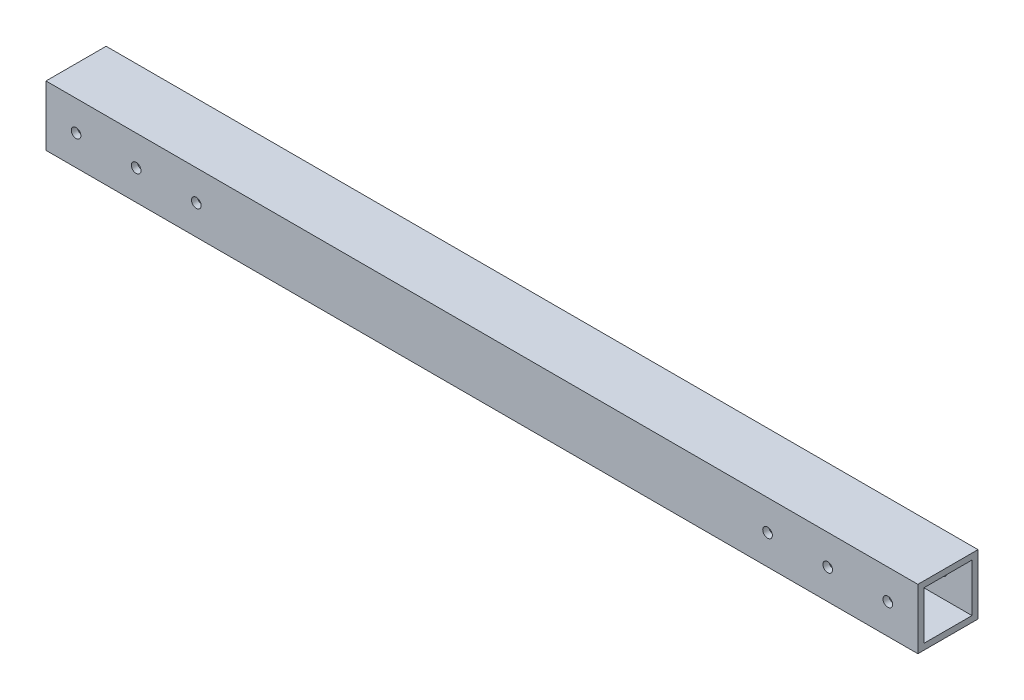
ISO-10303-21;
HEADER;
FILE_DESCRIPTION(('STEP AP214'),'2;1');
FILE_NAME('part.step','',(''),(''),'','','');
FILE_SCHEMA(('AUTOMOTIVE_DESIGN { 1 0 10303 214 1 1 1 1 }'));
ENDSEC;
DATA;
#1=APPLICATION_CONTEXT('core data for automotive mechanical design processes');
#2=APPLICATION_PROTOCOL_DEFINITION('international standard','automotive_design',2000,#1);
#3=PRODUCT_CONTEXT('',#1,'mechanical');
#4=PRODUCT('Part','Part','',(#3));
#5=PRODUCT_RELATED_PRODUCT_CATEGORY('part','',(#4));
#6=PRODUCT_DEFINITION_FORMATION('','',#4);
#7=PRODUCT_DEFINITION_CONTEXT('part definition',#1,'design');
#8=PRODUCT_DEFINITION('design','',#6,#7);
#9=PRODUCT_DEFINITION_SHAPE('','',#8);
#10=(LENGTH_UNIT() NAMED_UNIT(*) SI_UNIT(.MILLI.,.METRE.));
#11=(NAMED_UNIT(*) PLANE_ANGLE_UNIT() SI_UNIT($,.RADIAN.));
#12=(NAMED_UNIT(*) SI_UNIT($,.STERADIAN.) SOLID_ANGLE_UNIT());
#13=UNCERTAINTY_MEASURE_WITH_UNIT(LENGTH_MEASURE(1.E-05),#10,'distance_accuracy_value','');
#14=(GEOMETRIC_REPRESENTATION_CONTEXT(3) GLOBAL_UNCERTAINTY_ASSIGNED_CONTEXT((#13)) GLOBAL_UNIT_ASSIGNED_CONTEXT((#10,
#11,#12)) REPRESENTATION_CONTEXT('',''));
#15=CARTESIAN_POINT('',(0.,0.,0.));
#16=DIRECTION('',(0.,0.,1.));
#17=DIRECTION('',(1.,0.,0.));
#18=AXIS2_PLACEMENT_3D('',#15,#16,#17);
#19=CARTESIAN_POINT('',(147.497048213572,210.002006630731,20.));
#20=DIRECTION('',(1.,0.,0.));
#21=DIRECTION('',(0.,1.,0.));
#22=AXIS2_PLACEMENT_3D('',#19,#20,#21);
#23=PLANE('',#22);
#24=DIRECTION('',(0.,0.,1.));
#25=VECTOR('',#24,1.);
#26=CARTESIAN_POINT('',(147.497048213572,192.002006630731,2.));
#27=LINE('',#26,#25);
#28=CARTESIAN_POINT('',(147.497048213572,192.002006630731,2.00000000000001));
#29=VERTEX_POINT('',#28);
#30=CARTESIAN_POINT('',(147.497048213572,192.002006630731,18.));
#31=VERTEX_POINT('',#30);
#32=EDGE_CURVE('E111',#29,#31,#27,.T.);
#33=ORIENTED_EDGE('',*,*,#32,.F.);
#34=DIRECTION('',(0.,-1.,0.));
#35=VECTOR('',#34,1.);
#36=CARTESIAN_POINT('',(147.497048213572,208.002006630731,2.));
#37=LINE('',#36,#35);
#38=CARTESIAN_POINT('',(147.497048213572,208.002006630731,2.));
#39=VERTEX_POINT('',#38);
#40=EDGE_CURVE('E49',#39,#29,#37,.T.);
#41=ORIENTED_EDGE('',*,*,#40,.F.);
#42=DIRECTION('',(0.,0.,-1.));
#43=VECTOR('',#42,1.);
#44=CARTESIAN_POINT('',(147.497048213572,208.002006630731,2.));
#45=LINE('',#44,#43);
#46=CARTESIAN_POINT('',(147.497048213572,208.002006630731,18.));
#47=VERTEX_POINT('',#46);
#48=EDGE_CURVE('E117',#47,#39,#45,.T.);
#49=ORIENTED_EDGE('',*,*,#48,.F.);
#50=DIRECTION('',(0.,1.,0.));
#51=VECTOR('',#50,1.);
#52=CARTESIAN_POINT('',(147.497048213572,208.002006630731,18.));
#53=LINE('',#52,#51);
#54=EDGE_CURVE('E102',#31,#47,#53,.T.);
#55=ORIENTED_EDGE('',*,*,#54,.F.);
#56=EDGE_LOOP('',(#33,#41,#49,#55));
#57=FACE_BOUND('',#56,.T.);
#58=DIRECTION('',(0.,-1.,0.));
#59=VECTOR('',#58,1.);
#60=CARTESIAN_POINT('',(147.497048213572,210.002006630731,0.));
#61=LINE('',#60,#59);
#62=CARTESIAN_POINT('',(147.497048213572,210.002006630731,0.));
#63=VERTEX_POINT('',#62);
#64=CARTESIAN_POINT('',(147.497048213572,190.002006630731,0.));
#65=VERTEX_POINT('',#64);
#66=EDGE_CURVE('E124',#63,#65,#61,.T.);
#67=ORIENTED_EDGE('',*,*,#66,.T.);
#68=DIRECTION('',(0.,0.,-1.));
#69=VECTOR('',#68,1.);
#70=CARTESIAN_POINT('',(147.497048213572,190.002006630731,20.));
#71=LINE('',#70,#69);
#72=CARTESIAN_POINT('',(147.497048213572,190.002006630731,20.));
#73=VERTEX_POINT('',#72);
#74=EDGE_CURVE('E153',#73,#65,#71,.T.);
#75=ORIENTED_EDGE('',*,*,#74,.F.);
#76=DIRECTION('',(0.,-1.,0.));
#77=VECTOR('',#76,1.);
#78=CARTESIAN_POINT('',(147.497048213572,210.002006630731,20.));
#79=LINE('',#78,#77);
#80=CARTESIAN_POINT('',(147.497048213572,210.002006630731,20.));
#81=VERTEX_POINT('',#80);
#82=EDGE_CURVE('E127',#81,#73,#79,.T.);
#83=ORIENTED_EDGE('',*,*,#82,.F.);
#84=DIRECTION('',(0.,0.,-1.));
#85=VECTOR('',#84,1.);
#86=CARTESIAN_POINT('',(147.497048213572,210.002006630731,20.));
#87=LINE('',#86,#85);
#88=EDGE_CURVE('E137',#81,#63,#87,.T.);
#89=ORIENTED_EDGE('',*,*,#88,.T.);
#90=EDGE_LOOP('',(#67,#75,#83,#89));
#91=FACE_BOUND('',#90,.T.);
#92=ADVANCED_FACE('F33',(#57,#91),#23,.F.);
#93=CARTESIAN_POINT('',(147.497048213572,190.002006630731,20.));
#94=DIRECTION('',(0.,1.,0.));
#95=DIRECTION('',(0.,0.,1.));
#96=AXIS2_PLACEMENT_3D('',#93,#94,#95);
#97=PLANE('',#96);
#98=DIRECTION('',(1.,0.,0.));
#99=VECTOR('',#98,1.);
#100=CARTESIAN_POINT('',(147.497048213572,190.002006630731,0.));
#101=LINE('',#100,#99);
#102=CARTESIAN_POINT('',(437.497048213572,190.002006630731,0.));
#103=VERTEX_POINT('',#102);
#104=EDGE_CURVE('E140',#65,#103,#101,.T.);
#105=ORIENTED_EDGE('',*,*,#104,.T.);
#106=DIRECTION('',(0.,0.,-1.));
#107=VECTOR('',#106,1.);
#108=CARTESIAN_POINT('',(437.497048213572,190.002006630731,20.));
#109=LINE('',#108,#107);
#110=CARTESIAN_POINT('',(437.497048213572,190.002006630731,20.));
#111=VERTEX_POINT('',#110);
#112=EDGE_CURVE('E150',#111,#103,#109,.T.);
#113=ORIENTED_EDGE('',*,*,#112,.F.);
#114=DIRECTION('',(1.,0.,0.));
#115=VECTOR('',#114,1.);
#116=CARTESIAN_POINT('',(147.497048213572,190.002006630731,20.));
#117=LINE('',#116,#115);
#118=EDGE_CURVE('E130',#73,#111,#117,.T.);
#119=ORIENTED_EDGE('',*,*,#118,.F.);
#120=ORIENTED_EDGE('',*,*,#74,.T.);
#121=EDGE_LOOP('',(#105,#113,#119,#120));
#122=FACE_BOUND('',#121,.T.);
#123=ADVANCED_FACE('F222',(#122),#97,.F.);
#124=CARTESIAN_POINT('',(437.497048213572,210.002006630731,20.));
#125=DIRECTION('',(-1.,0.,0.));
#126=DIRECTION('',(0.,-1.,0.));
#127=AXIS2_PLACEMENT_3D('',#124,#125,#126);
#128=PLANE('',#127);
#129=DIRECTION('',(0.,0.,-1.));
#130=VECTOR('',#129,1.);
#131=CARTESIAN_POINT('',(437.497048213572,208.002006630732,20.));
#132=LINE('',#131,#130);
#133=CARTESIAN_POINT('',(437.497048213572,208.002006630732,18.));
#134=VERTEX_POINT('',#133);
#135=CARTESIAN_POINT('',(437.497048213572,208.002006630732,2.));
#136=VERTEX_POINT('',#135);
#137=EDGE_CURVE('E41',#134,#136,#132,.T.);
#138=ORIENTED_EDGE('',*,*,#137,.T.);
#139=DIRECTION('',(0.,-1.,0.));
#140=VECTOR('',#139,1.);
#141=CARTESIAN_POINT('',(437.497048213572,210.002006630731,2.));
#142=LINE('',#141,#140);
#143=CARTESIAN_POINT('',(437.497048213572,192.002006630732,2.));
#144=VERTEX_POINT('',#143);
#145=EDGE_CURVE('E11',#136,#144,#142,.T.);
#146=ORIENTED_EDGE('',*,*,#145,.T.);
#147=DIRECTION('',(0.,0.,1.));
#148=VECTOR('',#147,1.);
#149=CARTESIAN_POINT('',(437.497048213572,192.002006630732,20.));
#150=LINE('',#149,#148);
#151=CARTESIAN_POINT('',(437.497048213572,192.002006630732,18.));
#152=VERTEX_POINT('',#151);
#153=EDGE_CURVE('E156',#144,#152,#150,.T.);
#154=ORIENTED_EDGE('',*,*,#153,.T.);
#155=DIRECTION('',(0.,1.,0.));
#156=VECTOR('',#155,1.);
#157=CARTESIAN_POINT('',(437.497048213572,210.002006630731,18.));
#158=LINE('',#157,#156);
#159=EDGE_CURVE('E105',#152,#134,#158,.T.);
#160=ORIENTED_EDGE('',*,*,#159,.T.);
#161=EDGE_LOOP('',(#138,#146,#154,#160));
#162=FACE_BOUND('',#161,.T.);
#163=DIRECTION('',(0.,1.,0.));
#164=VECTOR('',#163,1.);
#165=CARTESIAN_POINT('',(437.497048213572,210.002006630731,0.));
#166=LINE('',#165,#164);
#167=CARTESIAN_POINT('',(437.497048213572,210.002006630731,0.));
#168=VERTEX_POINT('',#167);
#169=EDGE_CURVE('E142',#103,#168,#166,.T.);
#170=ORIENTED_EDGE('',*,*,#169,.T.);
#171=DIRECTION('',(0.,0.,-1.));
#172=VECTOR('',#171,1.);
#173=CARTESIAN_POINT('',(437.497048213572,210.002006630731,20.));
#174=LINE('',#173,#172);
#175=CARTESIAN_POINT('',(437.497048213572,210.002006630731,20.));
#176=VERTEX_POINT('',#175);
#177=EDGE_CURVE('E147',#176,#168,#174,.T.);
#178=ORIENTED_EDGE('',*,*,#177,.F.);
#179=DIRECTION('',(0.,1.,0.));
#180=VECTOR('',#179,1.);
#181=CARTESIAN_POINT('',(437.497048213572,210.002006630731,20.));
#182=LINE('',#181,#180);
#183=EDGE_CURVE('E133',#111,#176,#182,.T.);
#184=ORIENTED_EDGE('',*,*,#183,.F.);
#185=ORIENTED_EDGE('',*,*,#112,.T.);
#186=EDGE_LOOP('',(#170,#178,#184,#185));
#187=FACE_BOUND('',#186,.T.);
#188=ADVANCED_FACE('F226',(#162,#187),#128,.F.);
#189=CARTESIAN_POINT('',(147.497048213572,210.002006630731,20.));
#190=DIRECTION('',(0.,-1.,0.));
#191=DIRECTION('',(0.,0.,-1.));
#192=AXIS2_PLACEMENT_3D('',#189,#190,#191);
#193=PLANE('',#192);
#194=DIRECTION('',(-1.,0.,0.));
#195=VECTOR('',#194,1.);
#196=CARTESIAN_POINT('',(147.497048213572,210.002006630731,0.));
#197=LINE('',#196,#195);
#198=EDGE_CURVE('E131',#168,#63,#197,.T.);
#199=ORIENTED_EDGE('',*,*,#198,.T.);
#200=ORIENTED_EDGE('',*,*,#88,.F.);
#201=DIRECTION('',(-1.,0.,0.));
#202=VECTOR('',#201,1.);
#203=CARTESIAN_POINT('',(147.497048213572,210.002006630731,20.));
#204=LINE('',#203,#202);
#205=EDGE_CURVE('E135',#176,#81,#204,.T.);
#206=ORIENTED_EDGE('',*,*,#205,.F.);
#207=ORIENTED_EDGE('',*,*,#177,.T.);
#208=EDGE_LOOP('',(#199,#200,#206,#207));
#209=FACE_BOUND('',#208,.T.);
#210=ADVANCED_FACE('F231',(#209),#193,.F.);
#211=CARTESIAN_POINT('',(0.,0.,20.));
#212=DIRECTION('',(0.,0.,1.));
#213=DIRECTION('',(1.,0.,0.));
#214=AXIS2_PLACEMENT_3D('',#211,#212,#213);
#215=PLANE('',#214);
#216=CARTESIAN_POINT('',(427.497048213572,200.002006630731,20.));
#217=DIRECTION('',(0.,0.,1.));
#218=DIRECTION('',(1.,0.,0.));
#219=AXIS2_PLACEMENT_3D('',#216,#217,#218);
#220=CIRCLE('',#219,1.59999999999996);
#221=CARTESIAN_POINT('',(429.097048213572,200.002006630731,20.));
#222=VERTEX_POINT('',#221);
#223=EDGE_CURVE('E333',#222,#222,#220,.T.);
#224=ORIENTED_EDGE('',*,*,#223,.F.);
#225=EDGE_LOOP('',(#224));
#226=FACE_BOUND('',#225,.T.);
#227=CARTESIAN_POINT('',(407.497048213572,199.952453990143,20.));
#228=DIRECTION('',(0.,0.,1.));
#229=DIRECTION('',(1.,0.,0.));
#230=AXIS2_PLACEMENT_3D('',#227,#228,#229);
#231=CIRCLE('',#230,1.59999999999996);
#232=CARTESIAN_POINT('',(409.097048213572,199.952453990143,20.));
#233=VERTEX_POINT('',#232);
#234=EDGE_CURVE('E329',#233,#233,#231,.T.);
#235=ORIENTED_EDGE('',*,*,#234,.F.);
#236=EDGE_LOOP('',(#235));
#237=FACE_BOUND('',#236,.T.);
#238=CARTESIAN_POINT('',(387.497048213572,199.902901349555,20.));
#239=DIRECTION('',(0.,0.,1.));
#240=DIRECTION('',(1.,0.,0.));
#241=AXIS2_PLACEMENT_3D('',#238,#239,#240);
#242=CIRCLE('',#241,1.59999999999996);
#243=CARTESIAN_POINT('',(389.097048213572,199.902901349555,20.));
#244=VERTEX_POINT('',#243);
#245=EDGE_CURVE('E323',#244,#244,#242,.T.);
#246=ORIENTED_EDGE('',*,*,#245,.F.);
#247=EDGE_LOOP('',(#246));
#248=FACE_BOUND('',#247,.T.);
#249=CARTESIAN_POINT('',(197.497048213572,199.902901349555,20.));
#250=DIRECTION('',(0.,0.,1.));
#251=DIRECTION('',(1.,0.,0.));
#252=AXIS2_PLACEMENT_3D('',#249,#250,#251);
#253=CIRCLE('',#252,1.59999999999994);
#254=CARTESIAN_POINT('',(199.097048213572,199.902901349555,20.));
#255=VERTEX_POINT('',#254);
#256=EDGE_CURVE('E317',#255,#255,#253,.T.);
#257=ORIENTED_EDGE('',*,*,#256,.F.);
#258=EDGE_LOOP('',(#257));
#259=FACE_BOUND('',#258,.T.);
#260=CARTESIAN_POINT('',(177.497048213572,199.952453990143,20.));
#261=DIRECTION('',(0.,0.,1.));
#262=DIRECTION('',(1.,0.,0.));
#263=AXIS2_PLACEMENT_3D('',#260,#261,#262);
#264=CIRCLE('',#263,1.59999999999994);
#265=CARTESIAN_POINT('',(179.097048213572,199.952453990143,20.));
#266=VERTEX_POINT('',#265);
#267=EDGE_CURVE('E311',#266,#266,#264,.T.);
#268=ORIENTED_EDGE('',*,*,#267,.F.);
#269=EDGE_LOOP('',(#268));
#270=FACE_BOUND('',#269,.T.);
#271=CARTESIAN_POINT('',(157.497048213572,200.002006630731,20.));
#272=DIRECTION('',(0.,0.,1.));
#273=DIRECTION('',(1.,0.,0.));
#274=AXIS2_PLACEMENT_3D('',#271,#272,#273);
#275=CIRCLE('',#274,1.59999999999994);
#276=CARTESIAN_POINT('',(159.097048213572,200.002006630731,20.));
#277=VERTEX_POINT('',#276);
#278=EDGE_CURVE('E305',#277,#277,#275,.T.);
#279=ORIENTED_EDGE('',*,*,#278,.F.);
#280=EDGE_LOOP('',(#279));
#281=FACE_BOUND('',#280,.T.);
#282=ORIENTED_EDGE('',*,*,#82,.T.);
#283=ORIENTED_EDGE('',*,*,#118,.T.);
#284=ORIENTED_EDGE('',*,*,#183,.T.);
#285=ORIENTED_EDGE('',*,*,#205,.T.);
#286=EDGE_LOOP('',(#282,#283,#284,#285));
#287=FACE_BOUND('',#286,.T.);
#288=ADVANCED_FACE('F237',(#226,#237,#248,#259,#270,#281,#287),#215,.T.);
#289=CARTESIAN_POINT('',(0.,0.,0.));
#290=DIRECTION('',(0.,0.,1.));
#291=DIRECTION('',(1.,0.,0.));
#292=AXIS2_PLACEMENT_3D('',#289,#290,#291);
#293=PLANE('',#292);
#294=CARTESIAN_POINT('',(427.497048213572,200.002006630731,0.));
#295=DIRECTION('',(0.,0.,1.));
#296=DIRECTION('',(1.,0.,0.));
#297=AXIS2_PLACEMENT_3D('',#294,#295,#296);
#298=CIRCLE('',#297,1.59999999999996);
#299=CARTESIAN_POINT('',(429.097048213572,200.002006630731,0.));
#300=VERTEX_POINT('',#299);
#301=EDGE_CURVE('E165',#300,#300,#298,.T.);
#302=ORIENTED_EDGE('',*,*,#301,.T.);
#303=EDGE_LOOP('',(#302));
#304=FACE_BOUND('',#303,.T.);
#305=CARTESIAN_POINT('',(407.497048213572,199.952453990143,0.));
#306=DIRECTION('',(0.,0.,1.));
#307=DIRECTION('',(1.,0.,0.));
#308=AXIS2_PLACEMENT_3D('',#305,#306,#307);
#309=CIRCLE('',#308,1.59999999999996);
#310=CARTESIAN_POINT('',(409.097048213572,199.952453990143,0.));
#311=VERTEX_POINT('',#310);
#312=EDGE_CURVE('E276',#311,#311,#309,.T.);
#313=ORIENTED_EDGE('',*,*,#312,.T.);
#314=EDGE_LOOP('',(#313));
#315=FACE_BOUND('',#314,.T.);
#316=CARTESIAN_POINT('',(387.497048213572,199.902901349555,0.));
#317=DIRECTION('',(0.,0.,1.));
#318=DIRECTION('',(1.,0.,0.));
#319=AXIS2_PLACEMENT_3D('',#316,#317,#318);
#320=CIRCLE('',#319,1.59999999999996);
#321=CARTESIAN_POINT('',(389.097048213572,199.902901349555,0.));
#322=VERTEX_POINT('',#321);
#323=EDGE_CURVE('E326',#322,#322,#320,.T.);
#324=ORIENTED_EDGE('',*,*,#323,.T.);
#325=EDGE_LOOP('',(#324));
#326=FACE_BOUND('',#325,.T.);
#327=CARTESIAN_POINT('',(197.497048213572,199.902901349555,0.));
#328=DIRECTION('',(0.,0.,1.));
#329=DIRECTION('',(1.,0.,0.));
#330=AXIS2_PLACEMENT_3D('',#327,#328,#329);
#331=CIRCLE('',#330,1.59999999999994);
#332=CARTESIAN_POINT('',(199.097048213572,199.902901349555,0.));
#333=VERTEX_POINT('',#332);
#334=EDGE_CURVE('E320',#333,#333,#331,.T.);
#335=ORIENTED_EDGE('',*,*,#334,.T.);
#336=EDGE_LOOP('',(#335));
#337=FACE_BOUND('',#336,.T.);
#338=CARTESIAN_POINT('',(177.497048213572,199.952453990143,0.));
#339=DIRECTION('',(0.,0.,1.));
#340=DIRECTION('',(1.,0.,0.));
#341=AXIS2_PLACEMENT_3D('',#338,#339,#340);
#342=CIRCLE('',#341,1.59999999999994);
#343=CARTESIAN_POINT('',(179.097048213572,199.952453990143,0.));
#344=VERTEX_POINT('',#343);
#345=EDGE_CURVE('E314',#344,#344,#342,.T.);
#346=ORIENTED_EDGE('',*,*,#345,.T.);
#347=EDGE_LOOP('',(#346));
#348=FACE_BOUND('',#347,.T.);
#349=CARTESIAN_POINT('',(157.497048213572,200.002006630731,0.));
#350=DIRECTION('',(0.,0.,1.));
#351=DIRECTION('',(1.,0.,0.));
#352=AXIS2_PLACEMENT_3D('',#349,#350,#351);
#353=CIRCLE('',#352,1.59999999999994);
#354=CARTESIAN_POINT('',(159.097048213572,200.002006630731,0.));
#355=VERTEX_POINT('',#354);
#356=EDGE_CURVE('E308',#355,#355,#353,.T.);
#357=ORIENTED_EDGE('',*,*,#356,.T.);
#358=EDGE_LOOP('',(#357));
#359=FACE_BOUND('',#358,.T.);
#360=ORIENTED_EDGE('',*,*,#66,.F.);
#361=ORIENTED_EDGE('',*,*,#198,.F.);
#362=ORIENTED_EDGE('',*,*,#169,.F.);
#363=ORIENTED_EDGE('',*,*,#104,.F.);
#364=EDGE_LOOP('',(#360,#361,#362,#363));
#365=FACE_BOUND('',#364,.T.);
#366=ADVANCED_FACE('F239',(#304,#315,#326,#337,#348,#359,#365),#293,.F.);
#367=CARTESIAN_POINT('',(447.497048213572,208.002006630732,2.));
#368=DIRECTION('',(0.,0.,-1.));
#369=DIRECTION('',(0.,1.,0.));
#370=AXIS2_PLACEMENT_3D('',#367,#368,#369);
#371=PLANE('',#370);
#372=CARTESIAN_POINT('',(427.497048213572,200.002006630731,2.));
#373=DIRECTION('',(0.,0.,-1.));
#374=DIRECTION('',(0.,1.,0.));
#375=AXIS2_PLACEMENT_3D('',#372,#373,#374);
#376=CIRCLE('',#375,1.59999999999996);
#377=CARTESIAN_POINT('',(427.497048213572,201.602006630731,2.));
#378=VERTEX_POINT('',#377);
#379=EDGE_CURVE('E191',#378,#378,#376,.T.);
#380=ORIENTED_EDGE('',*,*,#379,.T.);
#381=EDGE_LOOP('',(#380));
#382=FACE_BOUND('',#381,.T.);
#383=CARTESIAN_POINT('',(407.497048213572,199.952453990143,2.));
#384=DIRECTION('',(0.,0.,-1.));
#385=DIRECTION('',(0.,1.,0.));
#386=AXIS2_PLACEMENT_3D('',#383,#384,#385);
#387=CIRCLE('',#386,1.59999999999996);
#388=CARTESIAN_POINT('',(407.497048213572,201.552453990143,2.));
#389=VERTEX_POINT('',#388);
#390=EDGE_CURVE('E179',#389,#389,#387,.T.);
#391=ORIENTED_EDGE('',*,*,#390,.T.);
#392=EDGE_LOOP('',(#391));
#393=FACE_BOUND('',#392,.T.);
#394=CARTESIAN_POINT('',(387.497048213572,199.902901349555,2.));
#395=DIRECTION('',(0.,0.,-1.));
#396=DIRECTION('',(0.,1.,0.));
#397=AXIS2_PLACEMENT_3D('',#394,#395,#396);
#398=CIRCLE('',#397,1.59999999999996);
#399=CARTESIAN_POINT('',(387.497048213572,201.502901349555,2.));
#400=VERTEX_POINT('',#399);
#401=EDGE_CURVE('E176',#400,#400,#398,.T.);
#402=ORIENTED_EDGE('',*,*,#401,.T.);
#403=EDGE_LOOP('',(#402));
#404=FACE_BOUND('',#403,.T.);
#405=CARTESIAN_POINT('',(197.497048213572,199.902901349555,2.));
#406=DIRECTION('',(0.,0.,-1.));
#407=DIRECTION('',(0.,1.,0.));
#408=AXIS2_PLACEMENT_3D('',#405,#406,#407);
#409=CIRCLE('',#408,1.59999999999994);
#410=CARTESIAN_POINT('',(197.497048213572,201.502901349555,2.));
#411=VERTEX_POINT('',#410);
#412=EDGE_CURVE('E173',#411,#411,#409,.T.);
#413=ORIENTED_EDGE('',*,*,#412,.T.);
#414=EDGE_LOOP('',(#413));
#415=FACE_BOUND('',#414,.T.);
#416=CARTESIAN_POINT('',(177.497048213572,199.952453990143,2.));
#417=DIRECTION('',(0.,0.,-1.));
#418=DIRECTION('',(0.,1.,0.));
#419=AXIS2_PLACEMENT_3D('',#416,#417,#418);
#420=CIRCLE('',#419,1.59999999999994);
#421=CARTESIAN_POINT('',(177.497048213572,201.552453990143,2.));
#422=VERTEX_POINT('',#421);
#423=EDGE_CURVE('E169',#422,#422,#420,.T.);
#424=ORIENTED_EDGE('',*,*,#423,.T.);
#425=EDGE_LOOP('',(#424));
#426=FACE_BOUND('',#425,.T.);
#427=CARTESIAN_POINT('',(157.497048213572,200.002006630731,2.));
#428=DIRECTION('',(0.,0.,-1.));
#429=DIRECTION('',(0.,1.,0.));
#430=AXIS2_PLACEMENT_3D('',#427,#428,#429);
#431=CIRCLE('',#430,1.59999999999994);
#432=CARTESIAN_POINT('',(157.497048213572,201.602006630731,2.));
#433=VERTEX_POINT('',#432);
#434=EDGE_CURVE('E164',#433,#433,#431,.T.);
#435=ORIENTED_EDGE('',*,*,#434,.T.);
#436=EDGE_LOOP('',(#435));
#437=FACE_BOUND('',#436,.T.);
#438=DIRECTION('',(-1.,0.,0.));
#439=VECTOR('',#438,1.);
#440=CARTESIAN_POINT('',(447.497048213572,208.002006630732,2.));
#441=LINE('',#440,#439);
#442=EDGE_CURVE('E122',#136,#39,#441,.T.);
#443=ORIENTED_EDGE('',*,*,#442,.T.);
#444=ORIENTED_EDGE('',*,*,#40,.T.);
#445=DIRECTION('',(-1.,0.,0.));
#446=VECTOR('',#445,1.);
#447=CARTESIAN_POINT('',(447.497048213572,192.002006630732,2.));
#448=LINE('',#447,#446);
#449=EDGE_CURVE('E108',#144,#29,#448,.T.);
#450=ORIENTED_EDGE('',*,*,#449,.F.);
#451=ORIENTED_EDGE('',*,*,#145,.F.);
#452=EDGE_LOOP('',(#443,#444,#450,#451));
#453=FACE_BOUND('',#452,.T.);
#454=ADVANCED_FACE('F242',(#382,#393,#404,#415,#426,#437,#453),#371,.F.);
#455=CARTESIAN_POINT('',(447.497048213572,208.002006630732,2.));
#456=DIRECTION('',(0.,1.,0.));
#457=DIRECTION('',(-1.,0.,0.));
#458=AXIS2_PLACEMENT_3D('',#455,#456,#457);
#459=PLANE('',#458);
#460=DIRECTION('',(-1.,0.,0.));
#461=VECTOR('',#460,1.);
#462=CARTESIAN_POINT('',(447.497048213572,208.002006630732,18.));
#463=LINE('',#462,#461);
#464=EDGE_CURVE('E107',#134,#47,#463,.T.);
#465=ORIENTED_EDGE('',*,*,#464,.T.);
#466=ORIENTED_EDGE('',*,*,#48,.T.);
#467=ORIENTED_EDGE('',*,*,#442,.F.);
#468=ORIENTED_EDGE('',*,*,#137,.F.);
#469=EDGE_LOOP('',(#465,#466,#467,#468));
#470=FACE_BOUND('',#469,.T.);
#471=ADVANCED_FACE('F249',(#470),#459,.F.);
#472=CARTESIAN_POINT('',(447.497048213572,208.002006630732,18.));
#473=DIRECTION('',(0.,0.,1.));
#474=DIRECTION('',(0.,-1.,0.));
#475=AXIS2_PLACEMENT_3D('',#472,#473,#474);
#476=PLANE('',#475);
#477=CARTESIAN_POINT('',(427.497048213572,200.002006630731,18.));
#478=DIRECTION('',(0.,0.,1.));
#479=DIRECTION('',(0.,-1.,0.));
#480=AXIS2_PLACEMENT_3D('',#477,#478,#479);
#481=CIRCLE('',#480,1.59999999999996);
#482=CARTESIAN_POINT('',(427.497048213572,198.402006630731,18.));
#483=VERTEX_POINT('',#482);
#484=EDGE_CURVE('E36',#483,#483,#481,.T.);
#485=ORIENTED_EDGE('',*,*,#484,.T.);
#486=EDGE_LOOP('',(#485));
#487=FACE_BOUND('',#486,.T.);
#488=CARTESIAN_POINT('',(407.497048213572,199.952453990143,18.));
#489=DIRECTION('',(0.,0.,1.));
#490=DIRECTION('',(0.,-1.,0.));
#491=AXIS2_PLACEMENT_3D('',#488,#489,#490);
#492=CIRCLE('',#491,1.59999999999996);
#493=CARTESIAN_POINT('',(407.497048213572,198.352453990143,18.));
#494=VERTEX_POINT('',#493);
#495=EDGE_CURVE('E177',#494,#494,#492,.T.);
#496=ORIENTED_EDGE('',*,*,#495,.T.);
#497=EDGE_LOOP('',(#496));
#498=FACE_BOUND('',#497,.T.);
#499=CARTESIAN_POINT('',(387.497048213572,199.902901349555,18.));
#500=DIRECTION('',(0.,0.,1.));
#501=DIRECTION('',(0.,-1.,0.));
#502=AXIS2_PLACEMENT_3D('',#499,#500,#501);
#503=CIRCLE('',#502,1.59999999999996);
#504=CARTESIAN_POINT('',(387.497048213572,198.302901349556,18.));
#505=VERTEX_POINT('',#504);
#506=EDGE_CURVE('E174',#505,#505,#503,.T.);
#507=ORIENTED_EDGE('',*,*,#506,.T.);
#508=EDGE_LOOP('',(#507));
#509=FACE_BOUND('',#508,.T.);
#510=CARTESIAN_POINT('',(197.497048213572,199.902901349555,18.));
#511=DIRECTION('',(0.,0.,1.));
#512=DIRECTION('',(0.,-1.,0.));
#513=AXIS2_PLACEMENT_3D('',#510,#511,#512);
#514=CIRCLE('',#513,1.59999999999994);
#515=CARTESIAN_POINT('',(197.497048213572,198.302901349556,18.));
#516=VERTEX_POINT('',#515);
#517=EDGE_CURVE('E170',#516,#516,#514,.T.);
#518=ORIENTED_EDGE('',*,*,#517,.T.);
#519=EDGE_LOOP('',(#518));
#520=FACE_BOUND('',#519,.T.);
#521=CARTESIAN_POINT('',(177.497048213572,199.952453990143,18.));
#522=DIRECTION('',(0.,0.,1.));
#523=DIRECTION('',(0.,-1.,0.));
#524=AXIS2_PLACEMENT_3D('',#521,#522,#523);
#525=CIRCLE('',#524,1.59999999999994);
#526=CARTESIAN_POINT('',(177.497048213572,198.352453990143,18.));
#527=VERTEX_POINT('',#526);
#528=EDGE_CURVE('E166',#527,#527,#525,.T.);
#529=ORIENTED_EDGE('',*,*,#528,.T.);
#530=EDGE_LOOP('',(#529));
#531=FACE_BOUND('',#530,.T.);
#532=CARTESIAN_POINT('',(157.497048213572,200.002006630731,18.));
#533=DIRECTION('',(0.,0.,1.));
#534=DIRECTION('',(0.,-1.,0.));
#535=AXIS2_PLACEMENT_3D('',#532,#533,#534);
#536=CIRCLE('',#535,1.59999999999994);
#537=CARTESIAN_POINT('',(157.497048213572,198.402006630731,18.));
#538=VERTEX_POINT('',#537);
#539=EDGE_CURVE('E161',#538,#538,#536,.T.);
#540=ORIENTED_EDGE('',*,*,#539,.T.);
#541=EDGE_LOOP('',(#540));
#542=FACE_BOUND('',#541,.T.);
#543=DIRECTION('',(-1.,0.,0.));
#544=VECTOR('',#543,1.);
#545=CARTESIAN_POINT('',(447.497048213572,192.002006630732,18.));
#546=LINE('',#545,#544);
#547=EDGE_CURVE('E57',#152,#31,#546,.T.);
#548=ORIENTED_EDGE('',*,*,#547,.T.);
#549=ORIENTED_EDGE('',*,*,#54,.T.);
#550=ORIENTED_EDGE('',*,*,#464,.F.);
#551=ORIENTED_EDGE('',*,*,#159,.F.);
#552=EDGE_LOOP('',(#548,#549,#550,#551));
#553=FACE_BOUND('',#552,.T.);
#554=ADVANCED_FACE('F99',(#487,#498,#509,#520,#531,#542,#553),#476,.F.);
#555=CARTESIAN_POINT('',(447.497048213572,192.002006630732,2.));
#556=DIRECTION('',(0.,-1.,0.));
#557=DIRECTION('',(1.,0.,0.));
#558=AXIS2_PLACEMENT_3D('',#555,#556,#557);
#559=PLANE('',#558);
#560=ORIENTED_EDGE('',*,*,#449,.T.);
#561=ORIENTED_EDGE('',*,*,#32,.T.);
#562=ORIENTED_EDGE('',*,*,#547,.F.);
#563=ORIENTED_EDGE('',*,*,#153,.F.);
#564=EDGE_LOOP('',(#560,#561,#562,#563));
#565=FACE_BOUND('',#564,.T.);
#566=ADVANCED_FACE('F112',(#565),#559,.F.);
#567=CARTESIAN_POINT('',(157.497048213572,200.002006630731,0.));
#568=DIRECTION('',(0.,0.,1.));
#569=DIRECTION('',(1.,0.,0.));
#570=AXIS2_PLACEMENT_3D('',#567,#568,#569);
#571=CYLINDRICAL_SURFACE('',#570,1.59999999999994);
#572=ORIENTED_EDGE('',*,*,#278,.T.);
#573=EDGE_LOOP('',(#572));
#574=FACE_BOUND('',#573,.T.);
#575=ORIENTED_EDGE('',*,*,#539,.F.);
#576=EDGE_LOOP('',(#575));
#577=FACE_BOUND('',#576,.T.);
#578=ADVANCED_FACE('F213',(#574,#577),#571,.F.);
#579=CARTESIAN_POINT('',(177.497048213572,199.952453990143,0.));
#580=DIRECTION('',(0.,0.,1.));
#581=DIRECTION('',(1.,0.,0.));
#582=AXIS2_PLACEMENT_3D('',#579,#580,#581);
#583=CYLINDRICAL_SURFACE('',#582,1.59999999999994);
#584=ORIENTED_EDGE('',*,*,#267,.T.);
#585=EDGE_LOOP('',(#584));
#586=FACE_BOUND('',#585,.T.);
#587=ORIENTED_EDGE('',*,*,#528,.F.);
#588=EDGE_LOOP('',(#587));
#589=FACE_BOUND('',#588,.T.);
#590=ADVANCED_FACE('F261',(#586,#589),#583,.F.);
#591=CARTESIAN_POINT('',(197.497048213572,199.902901349555,0.));
#592=DIRECTION('',(0.,0.,1.));
#593=DIRECTION('',(1.,0.,0.));
#594=AXIS2_PLACEMENT_3D('',#591,#592,#593);
#595=CYLINDRICAL_SURFACE('',#594,1.59999999999994);
#596=ORIENTED_EDGE('',*,*,#256,.T.);
#597=EDGE_LOOP('',(#596));
#598=FACE_BOUND('',#597,.T.);
#599=ORIENTED_EDGE('',*,*,#517,.F.);
#600=EDGE_LOOP('',(#599));
#601=FACE_BOUND('',#600,.T.);
#602=ADVANCED_FACE('F266',(#598,#601),#595,.F.);
#603=CARTESIAN_POINT('',(387.497048213572,199.902901349555,0.));
#604=DIRECTION('',(0.,0.,1.));
#605=DIRECTION('',(1.,0.,0.));
#606=AXIS2_PLACEMENT_3D('',#603,#604,#605);
#607=CYLINDRICAL_SURFACE('',#606,1.59999999999996);
#608=ORIENTED_EDGE('',*,*,#245,.T.);
#609=EDGE_LOOP('',(#608));
#610=FACE_BOUND('',#609,.T.);
#611=ORIENTED_EDGE('',*,*,#506,.F.);
#612=EDGE_LOOP('',(#611));
#613=FACE_BOUND('',#612,.T.);
#614=ADVANCED_FACE('F214',(#610,#613),#607,.F.);
#615=CARTESIAN_POINT('',(407.497048213572,199.952453990143,0.));
#616=DIRECTION('',(0.,0.,1.));
#617=DIRECTION('',(1.,0.,0.));
#618=AXIS2_PLACEMENT_3D('',#615,#616,#617);
#619=CYLINDRICAL_SURFACE('',#618,1.59999999999996);
#620=ORIENTED_EDGE('',*,*,#234,.T.);
#621=EDGE_LOOP('',(#620));
#622=FACE_BOUND('',#621,.T.);
#623=ORIENTED_EDGE('',*,*,#495,.F.);
#624=EDGE_LOOP('',(#623));
#625=FACE_BOUND('',#624,.T.);
#626=ADVANCED_FACE('F202',(#622,#625),#619,.F.);
#627=CARTESIAN_POINT('',(427.497048213572,200.002006630731,0.));
#628=DIRECTION('',(0.,0.,1.));
#629=DIRECTION('',(1.,0.,0.));
#630=AXIS2_PLACEMENT_3D('',#627,#628,#629);
#631=CYLINDRICAL_SURFACE('',#630,1.59999999999996);
#632=ORIENTED_EDGE('',*,*,#223,.T.);
#633=EDGE_LOOP('',(#632));
#634=FACE_BOUND('',#633,.T.);
#635=ORIENTED_EDGE('',*,*,#484,.F.);
#636=EDGE_LOOP('',(#635));
#637=FACE_BOUND('',#636,.T.);
#638=ADVANCED_FACE('F199',(#634,#637),#631,.F.);
#639=ORIENTED_EDGE('',*,*,#356,.F.);
#640=EDGE_LOOP('',(#639));
#641=FACE_BOUND('',#640,.T.);
#642=ORIENTED_EDGE('',*,*,#434,.F.);
#643=EDGE_LOOP('',(#642));
#644=FACE_BOUND('',#643,.T.);
#645=ADVANCED_FACE('F201',(#641,#644),#571,.F.);
#646=ORIENTED_EDGE('',*,*,#345,.F.);
#647=EDGE_LOOP('',(#646));
#648=FACE_BOUND('',#647,.T.);
#649=ORIENTED_EDGE('',*,*,#423,.F.);
#650=EDGE_LOOP('',(#649));
#651=FACE_BOUND('',#650,.T.);
#652=ADVANCED_FACE('F210',(#648,#651),#583,.F.);
#653=ORIENTED_EDGE('',*,*,#334,.F.);
#654=EDGE_LOOP('',(#653));
#655=FACE_BOUND('',#654,.T.);
#656=ORIENTED_EDGE('',*,*,#412,.F.);
#657=EDGE_LOOP('',(#656));
#658=FACE_BOUND('',#657,.T.);
#659=ADVANCED_FACE('F259',(#655,#658),#595,.F.);
#660=ORIENTED_EDGE('',*,*,#323,.F.);
#661=EDGE_LOOP('',(#660));
#662=FACE_BOUND('',#661,.T.);
#663=ORIENTED_EDGE('',*,*,#401,.F.);
#664=EDGE_LOOP('',(#663));
#665=FACE_BOUND('',#664,.T.);
#666=ADVANCED_FACE('F264',(#662,#665),#607,.F.);
#667=ORIENTED_EDGE('',*,*,#312,.F.);
#668=EDGE_LOOP('',(#667));
#669=FACE_BOUND('',#668,.T.);
#670=ORIENTED_EDGE('',*,*,#390,.F.);
#671=EDGE_LOOP('',(#670));
#672=FACE_BOUND('',#671,.T.);
#673=ADVANCED_FACE('F217',(#669,#672),#619,.F.);
#674=ORIENTED_EDGE('',*,*,#301,.F.);
#675=EDGE_LOOP('',(#674));
#676=FACE_BOUND('',#675,.T.);
#677=ORIENTED_EDGE('',*,*,#379,.F.);
#678=EDGE_LOOP('',(#677));
#679=FACE_BOUND('',#678,.T.);
#680=ADVANCED_FACE('F205',(#676,#679),#631,.F.);
#681=CLOSED_SHELL('',(#92,#123,#188,#210,#288,#366,#454,#471,#554,#566,#578,#590,#602,#614,#626,
#638,#645,#652,#659,#666,#673,#680));
#682=MANIFOLD_SOLID_BREP('B2',#681);
#683=ADVANCED_BREP_SHAPE_REPRESENTATION('',(#18,#682),#14);
#684=SHAPE_DEFINITION_REPRESENTATION(#9,#683);
ENDSEC;
END-ISO-10303-21;
